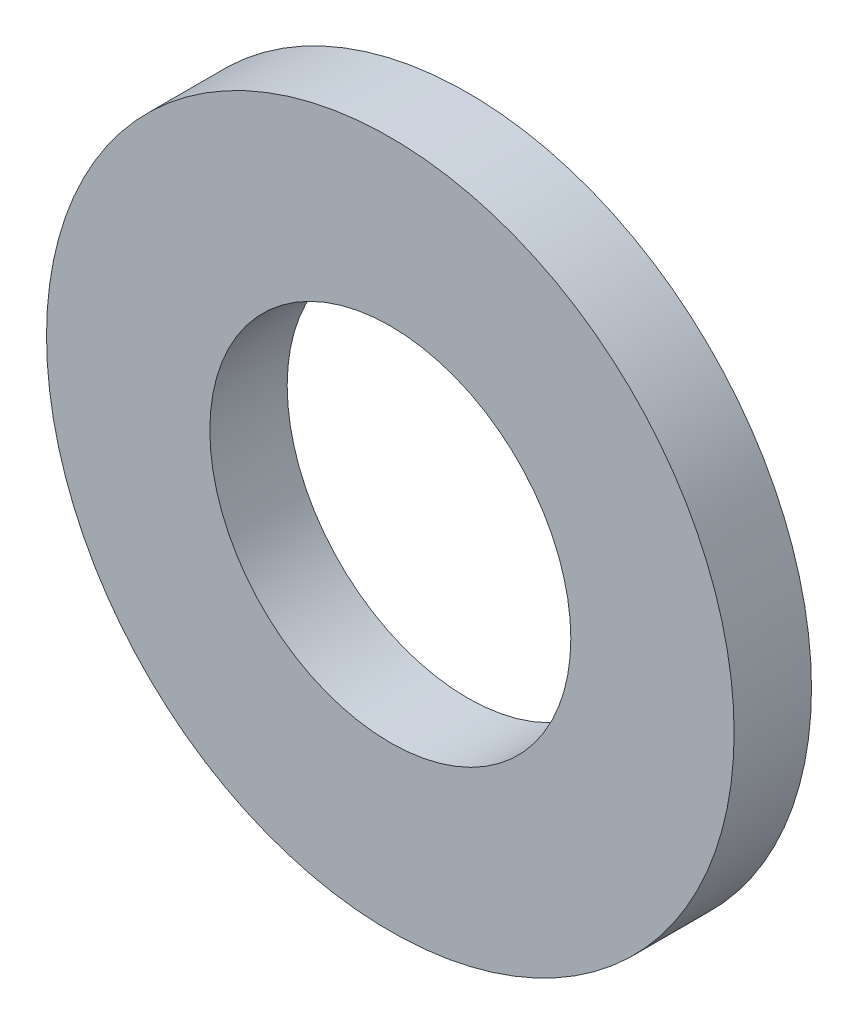
ISO-10303-21;
HEADER;
FILE_DESCRIPTION(('STEP AP214'),'2;1');
FILE_NAME('part.step','',(''),(''),'','','');
FILE_SCHEMA(('AUTOMOTIVE_DESIGN { 1 0 10303 214 1 1 1 1 }'));
ENDSEC;
DATA;
#1=APPLICATION_CONTEXT('core data for automotive mechanical design processes');
#2=APPLICATION_PROTOCOL_DEFINITION('international standard','automotive_design',2000,#1);
#3=PRODUCT_CONTEXT('',#1,'mechanical');
#4=PRODUCT('Part','Part','',(#3));
#5=PRODUCT_RELATED_PRODUCT_CATEGORY('part','',(#4));
#6=PRODUCT_DEFINITION_FORMATION('','',#4);
#7=PRODUCT_DEFINITION_CONTEXT('part definition',#1,'design');
#8=PRODUCT_DEFINITION('design','',#6,#7);
#9=PRODUCT_DEFINITION_SHAPE('','',#8);
#10=(LENGTH_UNIT() NAMED_UNIT(*) SI_UNIT(.MILLI.,.METRE.));
#11=(NAMED_UNIT(*) PLANE_ANGLE_UNIT() SI_UNIT($,.RADIAN.));
#12=(NAMED_UNIT(*) SI_UNIT($,.STERADIAN.) SOLID_ANGLE_UNIT());
#13=UNCERTAINTY_MEASURE_WITH_UNIT(LENGTH_MEASURE(1.E-05),#10,'distance_accuracy_value','');
#14=(GEOMETRIC_REPRESENTATION_CONTEXT(3) GLOBAL_UNCERTAINTY_ASSIGNED_CONTEXT((#13)) GLOBAL_UNIT_ASSIGNED_CONTEXT((#10,
#11,#12)) REPRESENTATION_CONTEXT('',''));
#15=CARTESIAN_POINT('',(0.,0.,0.));
#16=DIRECTION('',(0.,0.,1.));
#17=DIRECTION('',(1.,0.,0.));
#18=AXIS2_PLACEMENT_3D('',#15,#16,#17);
#19=CARTESIAN_POINT('',(0.,0.,0.));
#20=DIRECTION('',(0.,0.,1.));
#21=DIRECTION('',(1.,0.,0.));
#22=AXIS2_PLACEMENT_3D('',#19,#20,#21);
#23=PLANE('',#22);
#24=CARTESIAN_POINT('',(0.,0.,0.));
#25=DIRECTION('',(0.,0.,-1.));
#26=DIRECTION('',(-1.,0.,0.));
#27=AXIS2_PLACEMENT_3D('',#24,#25,#26);
#28=CIRCLE('',#27,4.19999999999999);
#29=CARTESIAN_POINT('',(-4.19999999999999,0.,0.));
#30=VERTEX_POINT('',#29);
#31=EDGE_CURVE('E27',#30,#30,#28,.F.);
#32=ORIENTED_EDGE('',*,*,#31,.T.);
#33=EDGE_LOOP('',(#32));
#34=FACE_BOUND('',#33,.T.);
#35=CARTESIAN_POINT('',(0.,0.,0.));
#36=DIRECTION('',(0.,0.,-1.));
#37=DIRECTION('',(-1.,0.,0.));
#38=AXIS2_PLACEMENT_3D('',#35,#36,#37);
#39=CIRCLE('',#38,8.);
#40=CARTESIAN_POINT('',(-8.,0.,0.));
#41=VERTEX_POINT('',#40);
#42=EDGE_CURVE('E18',#41,#41,#39,.F.);
#43=ORIENTED_EDGE('',*,*,#42,.F.);
#44=EDGE_LOOP('',(#43));
#45=FACE_BOUND('',#44,.T.);
#46=ADVANCED_FACE('F15',(#34,#45),#23,.F.);
#47=CARTESIAN_POINT('',(0.,0.,1.8));
#48=DIRECTION('',(0.,0.,-1.));
#49=DIRECTION('',(-1.,0.,0.));
#50=AXIS2_PLACEMENT_3D('',#47,#48,#49);
#51=CYLINDRICAL_SURFACE('',#50,8.);
#52=CARTESIAN_POINT('',(0.,0.,1.8));
#53=DIRECTION('',(0.,0.,-1.));
#54=DIRECTION('',(-1.,0.,0.));
#55=AXIS2_PLACEMENT_3D('',#52,#53,#54);
#56=CIRCLE('',#55,8.);
#57=CARTESIAN_POINT('',(-8.,0.,1.8));
#58=VERTEX_POINT('',#57);
#59=EDGE_CURVE('E22',#58,#58,#56,.F.);
#60=ORIENTED_EDGE('',*,*,#59,.F.);
#61=EDGE_LOOP('',(#60));
#62=FACE_BOUND('',#61,.T.);
#63=ORIENTED_EDGE('',*,*,#42,.T.);
#64=EDGE_LOOP('',(#63));
#65=FACE_BOUND('',#64,.T.);
#66=ADVANCED_FACE('F35',(#62,#65),#51,.T.);
#67=CARTESIAN_POINT('',(0.,0.,1.8));
#68=DIRECTION('',(0.,0.,-1.));
#69=DIRECTION('',(-1.,0.,0.));
#70=AXIS2_PLACEMENT_3D('',#67,#68,#69);
#71=CYLINDRICAL_SURFACE('',#70,4.19999999999999);
#72=ORIENTED_EDGE('',*,*,#31,.F.);
#73=EDGE_LOOP('',(#72));
#74=FACE_BOUND('',#73,.T.);
#75=CARTESIAN_POINT('',(0.,0.,1.8));
#76=DIRECTION('',(0.,0.,-1.));
#77=DIRECTION('',(-1.,0.,0.));
#78=AXIS2_PLACEMENT_3D('',#75,#76,#77);
#79=CIRCLE('',#78,4.19999999999999);
#80=CARTESIAN_POINT('',(-4.19999999999999,0.,1.8));
#81=VERTEX_POINT('',#80);
#82=EDGE_CURVE('E10',#81,#81,#79,.T.);
#83=ORIENTED_EDGE('',*,*,#82,.F.);
#84=EDGE_LOOP('',(#83));
#85=FACE_BOUND('',#84,.T.);
#86=ADVANCED_FACE('F42',(#74,#85),#71,.F.);
#87=CARTESIAN_POINT('',(0.,0.,1.8));
#88=DIRECTION('',(0.,0.,1.));
#89=DIRECTION('',(1.,0.,0.));
#90=AXIS2_PLACEMENT_3D('',#87,#88,#89);
#91=PLANE('',#90);
#92=ORIENTED_EDGE('',*,*,#82,.T.);
#93=EDGE_LOOP('',(#92));
#94=FACE_BOUND('',#93,.T.);
#95=ORIENTED_EDGE('',*,*,#59,.T.);
#96=EDGE_LOOP('',(#95));
#97=FACE_BOUND('',#96,.T.);
#98=ADVANCED_FACE('F44',(#94,#97),#91,.T.);
#99=CLOSED_SHELL('',(#46,#66,#86,#98));
#100=MANIFOLD_SOLID_BREP('B1',#99);
#101=ADVANCED_BREP_SHAPE_REPRESENTATION('',(#18,#100),#14);
#102=SHAPE_DEFINITION_REPRESENTATION(#9,#101);
ENDSEC;
END-ISO-10303-21;
